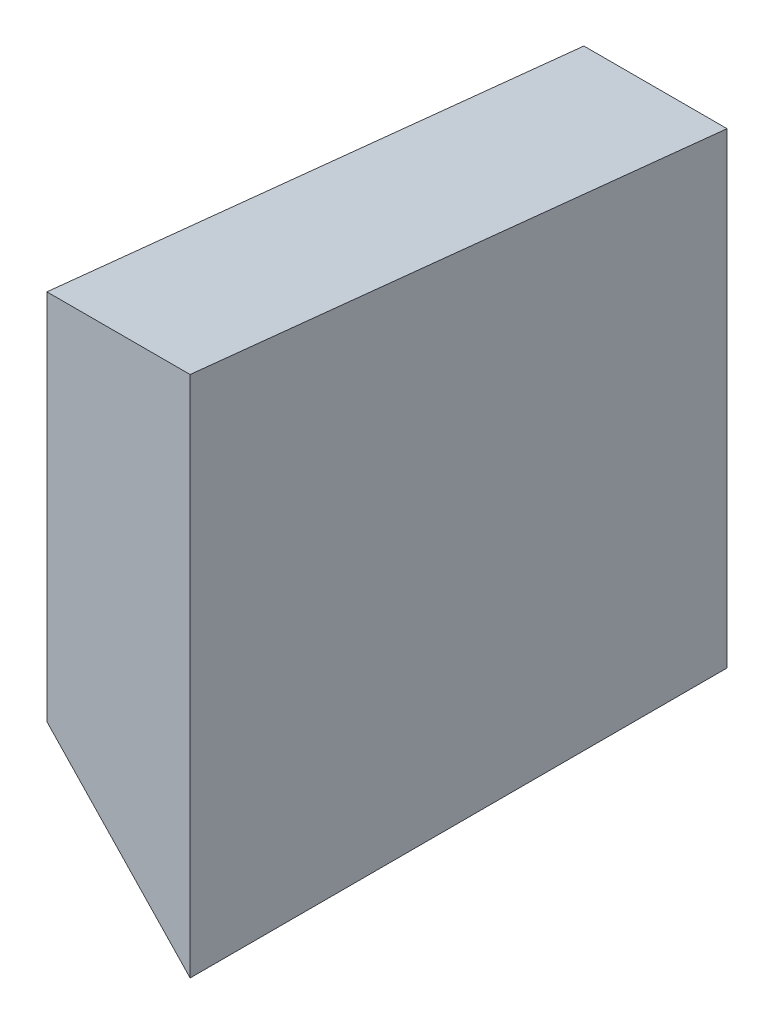
ISO-10303-21;
HEADER;
FILE_DESCRIPTION(('STEP AP214'),'2;1');
FILE_NAME('part.step','',(''),(''),'','','');
FILE_SCHEMA(('AUTOMOTIVE_DESIGN { 1 0 10303 214 1 1 1 1 }'));
ENDSEC;
DATA;
#1=APPLICATION_CONTEXT('core data for automotive mechanical design processes');
#2=APPLICATION_PROTOCOL_DEFINITION('international standard','automotive_design',2000,#1);
#3=PRODUCT_CONTEXT('',#1,'mechanical');
#4=PRODUCT('Part','Part','',(#3));
#5=PRODUCT_RELATED_PRODUCT_CATEGORY('part','',(#4));
#6=PRODUCT_DEFINITION_FORMATION('','',#4);
#7=PRODUCT_DEFINITION_CONTEXT('part definition',#1,'design');
#8=PRODUCT_DEFINITION('design','',#6,#7);
#9=PRODUCT_DEFINITION_SHAPE('','',#8);
#10=(LENGTH_UNIT() NAMED_UNIT(*) SI_UNIT(.MILLI.,.METRE.));
#11=(NAMED_UNIT(*) PLANE_ANGLE_UNIT() SI_UNIT($,.RADIAN.));
#12=(NAMED_UNIT(*) SI_UNIT($,.STERADIAN.) SOLID_ANGLE_UNIT());
#13=UNCERTAINTY_MEASURE_WITH_UNIT(LENGTH_MEASURE(1.E-05),#10,'distance_accuracy_value','');
#14=(GEOMETRIC_REPRESENTATION_CONTEXT(3) GLOBAL_UNCERTAINTY_ASSIGNED_CONTEXT((#13)) GLOBAL_UNIT_ASSIGNED_CONTEXT((#10,
#11,#12)) REPRESENTATION_CONTEXT('',''));
#15=CARTESIAN_POINT('',(0.,0.,0.));
#16=DIRECTION('',(0.,0.,1.));
#17=DIRECTION('',(1.,0.,0.));
#18=AXIS2_PLACEMENT_3D('',#15,#16,#17);
#19=CARTESIAN_POINT('',(-2.54,-20.828,0.));
#20=DIRECTION('',(-1.,0.,0.));
#21=DIRECTION('',(0.,0.,1.));
#22=AXIS2_PLACEMENT_3D('',#19,#20,#21);
#23=PLANE('',#22);
#24=DIRECTION('',(0.,1.,0.));
#25=VECTOR('',#24,1.);
#26=CARTESIAN_POINT('',(-2.54,-20.828,0.));
#27=LINE('',#26,#25);
#28=CARTESIAN_POINT('',(-2.54,-13.208,0.));
#29=VERTEX_POINT('',#28);
#30=CARTESIAN_POINT('',(-2.54,-1.97198641718141,0.));
#31=VERTEX_POINT('',#30);
#32=EDGE_CURVE('E11',#29,#31,#27,.T.);
#33=ORIENTED_EDGE('',*,*,#32,.F.);
#34=DIRECTION('',(0.,0.,1.));
#35=VECTOR('',#34,1.);
#36=CARTESIAN_POINT('',(-2.54,-13.208,0.));
#37=LINE('',#36,#35);
#38=CARTESIAN_POINT('',(-2.54,-13.208,19.05));
#39=VERTEX_POINT('',#38);
#40=EDGE_CURVE('E72',#29,#39,#37,.T.);
#41=ORIENTED_EDGE('',*,*,#40,.T.);
#42=DIRECTION('',(0.,1.,0.));
#43=VECTOR('',#42,1.);
#44=CARTESIAN_POINT('',(-2.54,-20.828,19.05));
#45=LINE('',#44,#43);
#46=CARTESIAN_POINT('',(-2.54,0.,19.05));
#47=VERTEX_POINT('',#46);
#48=EDGE_CURVE('E36',#39,#47,#45,.T.);
#49=ORIENTED_EDGE('',*,*,#48,.T.);
#50=DIRECTION('',(0.,-0.102966143613117,-0.994684861284941));
#51=VECTOR('',#50,1.);
#52=CARTESIAN_POINT('',(-2.54,-1.97198641718141,0.));
#53=LINE('',#52,#51);
#54=EDGE_CURVE('E85',#47,#31,#53,.T.);
#55=ORIENTED_EDGE('',*,*,#54,.T.);
#56=EDGE_LOOP('',(#33,#41,#49,#55));
#57=FACE_BOUND('',#56,.T.);
#58=ADVANCED_FACE('F33',(#57),#23,.T.);
#59=CARTESIAN_POINT('',(-2.54,-20.828,0.));
#60=DIRECTION('',(0.,0.,-1.));
#61=DIRECTION('',(-1.,0.,0.));
#62=AXIS2_PLACEMENT_3D('',#59,#60,#61);
#63=PLANE('',#62);
#64=DIRECTION('',(0.,1.,0.));
#65=VECTOR('',#64,1.);
#66=CARTESIAN_POINT('',(2.54,-20.828,0.));
#67=LINE('',#66,#65);
#68=CARTESIAN_POINT('',(2.54,-18.542,0.));
#69=VERTEX_POINT('',#68);
#70=CARTESIAN_POINT('',(2.54,-1.97198641718141,0.));
#71=VERTEX_POINT('',#70);
#72=EDGE_CURVE('E41',#69,#71,#67,.T.);
#73=ORIENTED_EDGE('',*,*,#72,.F.);
#74=DIRECTION('',(0.689655172413793,-0.724137931034483,0.));
#75=VECTOR('',#74,1.);
#76=CARTESIAN_POINT('',(-7.92806183115339,-7.55053507728894,0.));
#77=LINE('',#76,#75);
#78=EDGE_CURVE('E75',#29,#69,#77,.T.);
#79=ORIENTED_EDGE('',*,*,#78,.F.);
#80=ORIENTED_EDGE('',*,*,#32,.T.);
#81=DIRECTION('',(1.,0.,0.));
#82=VECTOR('',#81,1.);
#83=CARTESIAN_POINT('',(-2.54,-1.97198641718141,0.));
#84=LINE('',#83,#82);
#85=EDGE_CURVE('E89',#31,#71,#84,.T.);
#86=ORIENTED_EDGE('',*,*,#85,.T.);
#87=EDGE_LOOP('',(#73,#79,#80,#86));
#88=FACE_BOUND('',#87,.T.);
#89=ADVANCED_FACE('F81',(#88),#63,.T.);
#90=CARTESIAN_POINT('',(2.54,-20.828,0.));
#91=DIRECTION('',(1.,0.,0.));
#92=DIRECTION('',(0.,0.,-1.));
#93=AXIS2_PLACEMENT_3D('',#90,#91,#92);
#94=PLANE('',#93);
#95=DIRECTION('',(0.,1.,0.));
#96=VECTOR('',#95,1.);
#97=CARTESIAN_POINT('',(2.54,-20.828,19.05));
#98=LINE('',#97,#96);
#99=CARTESIAN_POINT('',(2.54,-18.542,19.05));
#100=VERTEX_POINT('',#99);
#101=CARTESIAN_POINT('',(2.54,0.,19.05));
#102=VERTEX_POINT('',#101);
#103=EDGE_CURVE('E99',#100,#102,#98,.T.);
#104=ORIENTED_EDGE('',*,*,#103,.F.);
#105=DIRECTION('',(0.,0.,1.));
#106=VECTOR('',#105,1.);
#107=CARTESIAN_POINT('',(2.54,-18.542,0.));
#108=LINE('',#107,#106);
#109=EDGE_CURVE('E49',#69,#100,#108,.T.);
#110=ORIENTED_EDGE('',*,*,#109,.F.);
#111=ORIENTED_EDGE('',*,*,#72,.T.);
#112=DIRECTION('',(0.,-0.102966143613117,-0.994684861284941));
#113=VECTOR('',#112,1.);
#114=CARTESIAN_POINT('',(2.54,-1.97198641718141,0.));
#115=LINE('',#114,#113);
#116=EDGE_CURVE('E90',#102,#71,#115,.T.);
#117=ORIENTED_EDGE('',*,*,#116,.F.);
#118=EDGE_LOOP('',(#104,#110,#111,#117));
#119=FACE_BOUND('',#118,.T.);
#120=ADVANCED_FACE('F106',(#119),#94,.T.);
#121=CARTESIAN_POINT('',(-2.54,-20.828,19.05));
#122=DIRECTION('',(0.,0.,1.));
#123=DIRECTION('',(1.,0.,0.));
#124=AXIS2_PLACEMENT_3D('',#121,#122,#123);
#125=PLANE('',#124);
#126=ORIENTED_EDGE('',*,*,#48,.F.);
#127=DIRECTION('',(0.689655172413793,-0.724137931034483,0.));
#128=VECTOR('',#127,1.);
#129=CARTESIAN_POINT('',(-7.92806183115339,-7.55053507728894,19.05));
#130=LINE('',#129,#128);
#131=EDGE_CURVE('E76',#39,#100,#130,.T.);
#132=ORIENTED_EDGE('',*,*,#131,.T.);
#133=ORIENTED_EDGE('',*,*,#103,.T.);
#134=DIRECTION('',(1.,0.,0.));
#135=VECTOR('',#134,1.);
#136=CARTESIAN_POINT('',(-2.54,0.,19.05));
#137=LINE('',#136,#135);
#138=EDGE_CURVE('E92',#47,#102,#137,.T.);
#139=ORIENTED_EDGE('',*,*,#138,.F.);
#140=EDGE_LOOP('',(#126,#132,#133,#139));
#141=FACE_BOUND('',#140,.T.);
#142=ADVANCED_FACE('F102',(#141),#125,.T.);
#143=CARTESIAN_POINT('',(-2.54,-1.97198641718141,0.));
#144=DIRECTION('',(0.,-0.994684861284941,0.102966143613117));
#145=DIRECTION('',(0.,-0.102966143613117,-0.994684861284941));
#146=AXIS2_PLACEMENT_3D('',#143,#144,#145);
#147=PLANE('',#146);
#148=ORIENTED_EDGE('',*,*,#116,.T.);
#149=ORIENTED_EDGE('',*,*,#85,.F.);
#150=ORIENTED_EDGE('',*,*,#54,.F.);
#151=ORIENTED_EDGE('',*,*,#138,.T.);
#152=EDGE_LOOP('',(#148,#149,#150,#151));
#153=FACE_BOUND('',#152,.T.);
#154=ADVANCED_FACE('F105',(#153),#147,.F.);
#155=CARTESIAN_POINT('',(-7.92806183115339,-7.55053507728894,0.));
#156=DIRECTION('',(-0.724137931034483,-0.689655172413793,0.));
#157=DIRECTION('',(0.689655172413793,-0.724137931034483,0.));
#158=AXIS2_PLACEMENT_3D('',#155,#156,#157);
#159=PLANE('',#158);
#160=ORIENTED_EDGE('',*,*,#131,.F.);
#161=ORIENTED_EDGE('',*,*,#40,.F.);
#162=ORIENTED_EDGE('',*,*,#78,.T.);
#163=ORIENTED_EDGE('',*,*,#109,.T.);
#164=EDGE_LOOP('',(#160,#161,#162,#163));
#165=FACE_BOUND('',#164,.T.);
#166=ADVANCED_FACE('F74',(#165),#159,.T.);
#167=CLOSED_SHELL('',(#58,#89,#120,#142,#154,#166));
#168=MANIFOLD_SOLID_BREP('B2',#167);
#169=ADVANCED_BREP_SHAPE_REPRESENTATION('',(#18,#168),#14);
#170=SHAPE_DEFINITION_REPRESENTATION(#9,#169);
ENDSEC;
END-ISO-10303-21;
